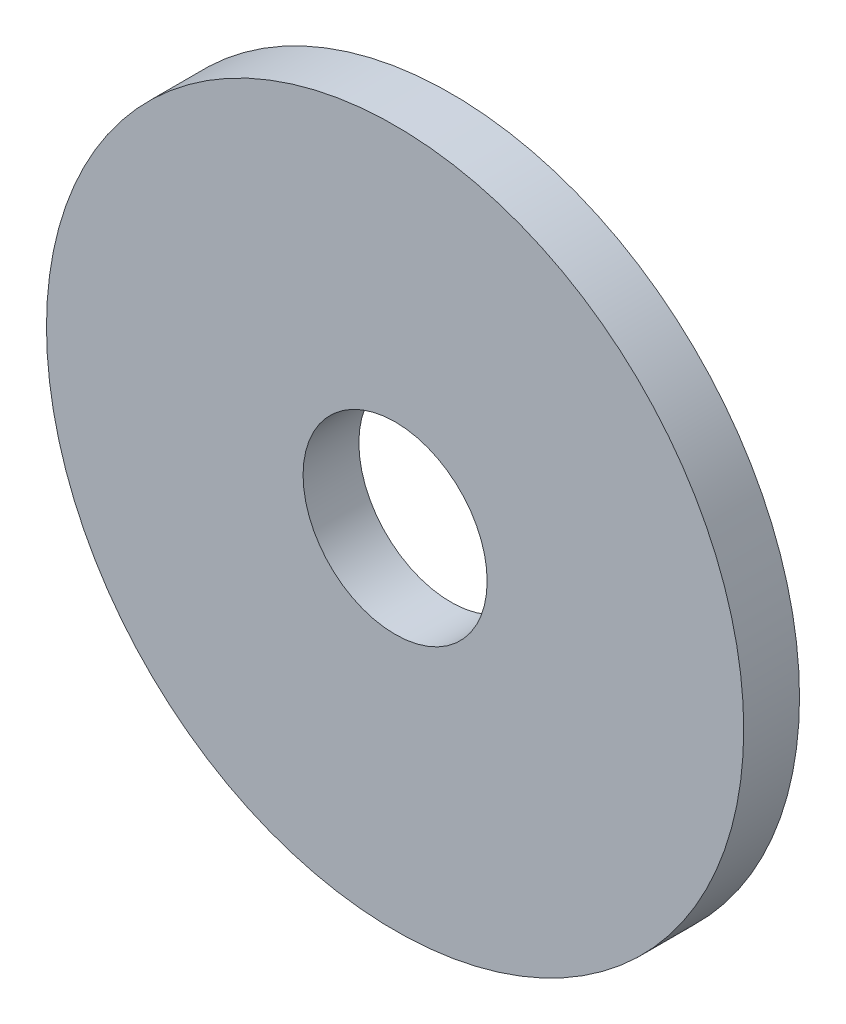
ISO-10303-21;
HEADER;
FILE_DESCRIPTION(('STEP AP214'),'2;1');
FILE_NAME('part.step','',(''),(''),'','','');
FILE_SCHEMA(('AUTOMOTIVE_DESIGN { 1 0 10303 214 1 1 1 1 }'));
ENDSEC;
DATA;
#1=APPLICATION_CONTEXT('core data for automotive mechanical design processes');
#2=APPLICATION_PROTOCOL_DEFINITION('international standard','automotive_design',2000,#1);
#3=PRODUCT_CONTEXT('',#1,'mechanical');
#4=PRODUCT('Part','Part','',(#3));
#5=PRODUCT_RELATED_PRODUCT_CATEGORY('part','',(#4));
#6=PRODUCT_DEFINITION_FORMATION('','',#4);
#7=PRODUCT_DEFINITION_CONTEXT('part definition',#1,'design');
#8=PRODUCT_DEFINITION('design','',#6,#7);
#9=PRODUCT_DEFINITION_SHAPE('','',#8);
#10=(LENGTH_UNIT() NAMED_UNIT(*) SI_UNIT(.MILLI.,.METRE.));
#11=(NAMED_UNIT(*) PLANE_ANGLE_UNIT() SI_UNIT($,.RADIAN.));
#12=(NAMED_UNIT(*) SI_UNIT($,.STERADIAN.) SOLID_ANGLE_UNIT());
#13=UNCERTAINTY_MEASURE_WITH_UNIT(LENGTH_MEASURE(1.E-05),#10,'distance_accuracy_value','');
#14=(GEOMETRIC_REPRESENTATION_CONTEXT(3) GLOBAL_UNCERTAINTY_ASSIGNED_CONTEXT((#13)) GLOBAL_UNIT_ASSIGNED_CONTEXT((#10,
#11,#12)) REPRESENTATION_CONTEXT('',''));
#15=CARTESIAN_POINT('',(0.,0.,0.));
#16=DIRECTION('',(0.,0.,1.));
#17=DIRECTION('',(1.,0.,0.));
#18=AXIS2_PLACEMENT_3D('',#15,#16,#17);
#19=CARTESIAN_POINT('',(0.,0.,2.));
#20=DIRECTION('',(0.,0.,-1.));
#21=DIRECTION('',(-1.,0.,0.));
#22=AXIS2_PLACEMENT_3D('',#19,#20,#21);
#23=CYLINDRICAL_SURFACE('',#22,12.5);
#24=CARTESIAN_POINT('',(0.,0.,2.));
#25=DIRECTION('',(0.,0.,1.));
#26=DIRECTION('',(1.,0.,0.));
#27=AXIS2_PLACEMENT_3D('',#24,#25,#26);
#28=CIRCLE('',#27,12.5);
#29=CARTESIAN_POINT('',(12.5,0.,2.));
#30=VERTEX_POINT('',#29);
#31=EDGE_CURVE('E10',#30,#30,#28,.T.);
#32=ORIENTED_EDGE('',*,*,#31,.F.);
#33=EDGE_LOOP('',(#32));
#34=FACE_BOUND('',#33,.T.);
#35=CARTESIAN_POINT('',(0.,0.,0.));
#36=DIRECTION('',(0.,0.,1.));
#37=DIRECTION('',(1.,0.,0.));
#38=AXIS2_PLACEMENT_3D('',#35,#36,#37);
#39=CIRCLE('',#38,12.5);
#40=CARTESIAN_POINT('',(12.5,0.,0.));
#41=VERTEX_POINT('',#40);
#42=EDGE_CURVE('E35',#41,#41,#39,.T.);
#43=ORIENTED_EDGE('',*,*,#42,.T.);
#44=EDGE_LOOP('',(#43));
#45=FACE_BOUND('',#44,.T.);
#46=ADVANCED_FACE('F32',(#34,#45),#23,.T.);
#47=CARTESIAN_POINT('',(0.,0.,2.));
#48=DIRECTION('',(0.,0.,1.));
#49=DIRECTION('',(1.,0.,0.));
#50=AXIS2_PLACEMENT_3D('',#47,#48,#49);
#51=PLANE('',#50);
#52=CARTESIAN_POINT('',(0.,0.,2.));
#53=DIRECTION('',(0.,0.,1.));
#54=DIRECTION('',(1.,0.,0.));
#55=AXIS2_PLACEMENT_3D('',#52,#53,#54);
#56=CIRCLE('',#55,3.29999999999999);
#57=CARTESIAN_POINT('',(3.29999999999999,0.,2.));
#58=VERTEX_POINT('',#57);
#59=EDGE_CURVE('E42',#58,#58,#56,.T.);
#60=ORIENTED_EDGE('',*,*,#59,.F.);
#61=EDGE_LOOP('',(#60));
#62=FACE_BOUND('',#61,.T.);
#63=ORIENTED_EDGE('',*,*,#31,.T.);
#64=EDGE_LOOP('',(#63));
#65=FACE_BOUND('',#64,.T.);
#66=ADVANCED_FACE('F55',(#62,#65),#51,.T.);
#67=CARTESIAN_POINT('',(0.,0.,0.));
#68=DIRECTION('',(0.,0.,1.));
#69=DIRECTION('',(1.,0.,0.));
#70=AXIS2_PLACEMENT_3D('',#67,#68,#69);
#71=PLANE('',#70);
#72=CARTESIAN_POINT('',(0.,0.,0.));
#73=DIRECTION('',(0.,0.,-1.));
#74=DIRECTION('',(-1.,0.,0.));
#75=AXIS2_PLACEMENT_3D('',#72,#73,#74);
#76=CIRCLE('',#75,3.29999999999999);
#77=CARTESIAN_POINT('',(-3.29999999999999,0.,0.));
#78=VERTEX_POINT('',#77);
#79=EDGE_CURVE('E46',#78,#78,#76,.T.);
#80=ORIENTED_EDGE('',*,*,#79,.F.);
#81=EDGE_LOOP('',(#80));
#82=FACE_BOUND('',#81,.T.);
#83=ORIENTED_EDGE('',*,*,#42,.F.);
#84=EDGE_LOOP('',(#83));
#85=FACE_BOUND('',#84,.T.);
#86=ADVANCED_FACE('F52',(#82,#85),#71,.F.);
#87=CARTESIAN_POINT('',(0.,0.,0.));
#88=DIRECTION('',(0.,0.,-1.));
#89=DIRECTION('',(-1.,0.,0.));
#90=AXIS2_PLACEMENT_3D('',#87,#88,#89);
#91=CYLINDRICAL_SURFACE('',#90,3.29999999999999);
#92=ORIENTED_EDGE('',*,*,#59,.T.);
#93=EDGE_LOOP('',(#92));
#94=FACE_BOUND('',#93,.T.);
#95=ORIENTED_EDGE('',*,*,#79,.T.);
#96=EDGE_LOOP('',(#95));
#97=FACE_BOUND('',#96,.T.);
#98=ADVANCED_FACE('F50',(#94,#97),#91,.F.);
#99=CLOSED_SHELL('',(#46,#66,#86,#98));
#100=MANIFOLD_SOLID_BREP('B2',#99);
#101=ADVANCED_BREP_SHAPE_REPRESENTATION('',(#18,#100),#14);
#102=SHAPE_DEFINITION_REPRESENTATION(#9,#101);
ENDSEC;
END-ISO-10303-21;
